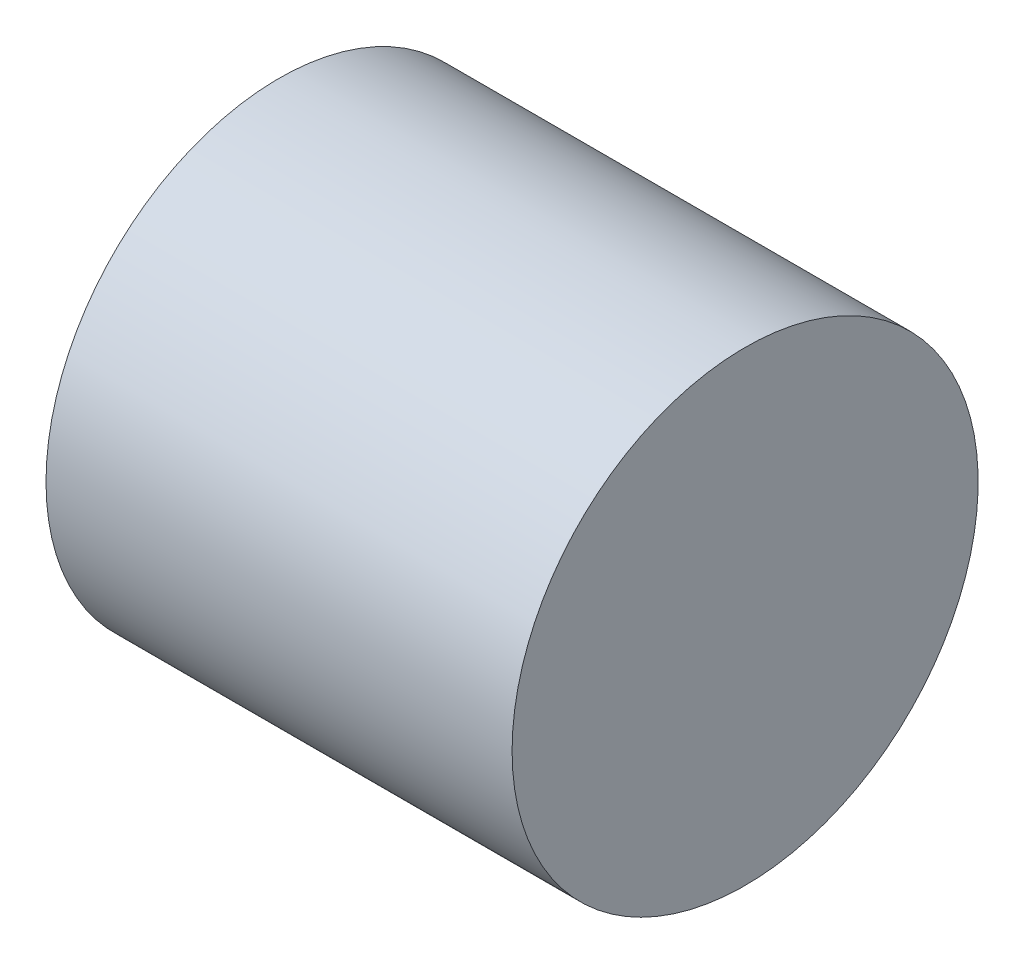
ISO-10303-21;
HEADER;
FILE_DESCRIPTION(('STEP AP214'),'2;1');
FILE_NAME('part.step','',(''),(''),'','','');
FILE_SCHEMA(('AUTOMOTIVE_DESIGN { 1 0 10303 214 1 1 1 1 }'));
ENDSEC;
DATA;
#1=APPLICATION_CONTEXT('core data for automotive mechanical design processes');
#2=APPLICATION_PROTOCOL_DEFINITION('international standard','automotive_design',2000,#1);
#3=PRODUCT_CONTEXT('',#1,'mechanical');
#4=PRODUCT('Part','Part','',(#3));
#5=PRODUCT_RELATED_PRODUCT_CATEGORY('part','',(#4));
#6=PRODUCT_DEFINITION_FORMATION('','',#4);
#7=PRODUCT_DEFINITION_CONTEXT('part definition',#1,'design');
#8=PRODUCT_DEFINITION('design','',#6,#7);
#9=PRODUCT_DEFINITION_SHAPE('','',#8);
#10=(LENGTH_UNIT() NAMED_UNIT(*) SI_UNIT(.MILLI.,.METRE.));
#11=(NAMED_UNIT(*) PLANE_ANGLE_UNIT() SI_UNIT($,.RADIAN.));
#12=(NAMED_UNIT(*) SI_UNIT($,.STERADIAN.) SOLID_ANGLE_UNIT());
#13=UNCERTAINTY_MEASURE_WITH_UNIT(LENGTH_MEASURE(1.E-05),#10,'distance_accuracy_value','');
#14=(GEOMETRIC_REPRESENTATION_CONTEXT(3) GLOBAL_UNCERTAINTY_ASSIGNED_CONTEXT((#13)) GLOBAL_UNIT_ASSIGNED_CONTEXT((#10,
#11,#12)) REPRESENTATION_CONTEXT('',''));
#15=CARTESIAN_POINT('',(0.,0.,0.));
#16=DIRECTION('',(0.,0.,1.));
#17=DIRECTION('',(1.,0.,0.));
#18=AXIS2_PLACEMENT_3D('',#15,#16,#17);
#19=CARTESIAN_POINT('',(0.,0.,0.));
#20=DIRECTION('',(-1.,0.,0.));
#21=DIRECTION('',(0.,0.,1.));
#22=AXIS2_PLACEMENT_3D('',#19,#20,#21);
#23=PLANE('',#22);
#24=CARTESIAN_POINT('',(0.,20.,0.));
#25=DIRECTION('',(-1.,0.,0.));
#26=DIRECTION('',(0.,0.,1.));
#27=AXIS2_PLACEMENT_3D('',#24,#25,#26);
#28=CIRCLE('',#27,20.);
#29=CARTESIAN_POINT('',(0.,20.,20.));
#30=VERTEX_POINT('',#29);
#31=EDGE_CURVE('E46',#30,#30,#28,.T.);
#32=ORIENTED_EDGE('',*,*,#31,.T.);
#33=EDGE_LOOP('',(#32));
#34=FACE_BOUND('',#33,.T.);
#35=ADVANCED_FACE('F39',(#34),#23,.T.);
#36=CARTESIAN_POINT('',(40.,0.,0.));
#37=DIRECTION('',(1.,0.,0.));
#38=DIRECTION('',(0.,0.,-1.));
#39=AXIS2_PLACEMENT_3D('',#36,#37,#38);
#40=PLANE('',#39);
#41=CARTESIAN_POINT('',(40.,20.,0.));
#42=DIRECTION('',(-1.,0.,0.));
#43=DIRECTION('',(0.,0.,1.));
#44=AXIS2_PLACEMENT_3D('',#41,#42,#43);
#45=CIRCLE('',#44,20.);
#46=CARTESIAN_POINT('',(40.,20.,20.));
#47=VERTEX_POINT('',#46);
#48=EDGE_CURVE('E10',#47,#47,#45,.T.);
#49=ORIENTED_EDGE('',*,*,#48,.F.);
#50=EDGE_LOOP('',(#49));
#51=FACE_BOUND('',#50,.T.);
#52=ADVANCED_FACE('F56',(#51),#40,.T.);
#53=CARTESIAN_POINT('',(0.,20.,0.));
#54=DIRECTION('',(-1.,0.,0.));
#55=DIRECTION('',(0.,0.,1.));
#56=AXIS2_PLACEMENT_3D('',#53,#54,#55);
#57=CYLINDRICAL_SURFACE('',#56,20.);
#58=ORIENTED_EDGE('',*,*,#48,.T.);
#59=EDGE_LOOP('',(#58));
#60=FACE_BOUND('',#59,.T.);
#61=ORIENTED_EDGE('',*,*,#31,.F.);
#62=EDGE_LOOP('',(#61));
#63=FACE_BOUND('',#62,.T.);
#64=ADVANCED_FACE('F54',(#60,#63),#57,.T.);
#65=CLOSED_SHELL('',(#35,#52,#64));
#66=MANIFOLD_SOLID_BREP('B2',#65);
#67=ADVANCED_BREP_SHAPE_REPRESENTATION('',(#18,#66),#14);
#68=SHAPE_DEFINITION_REPRESENTATION(#9,#67);
ENDSEC;
END-ISO-10303-21;
